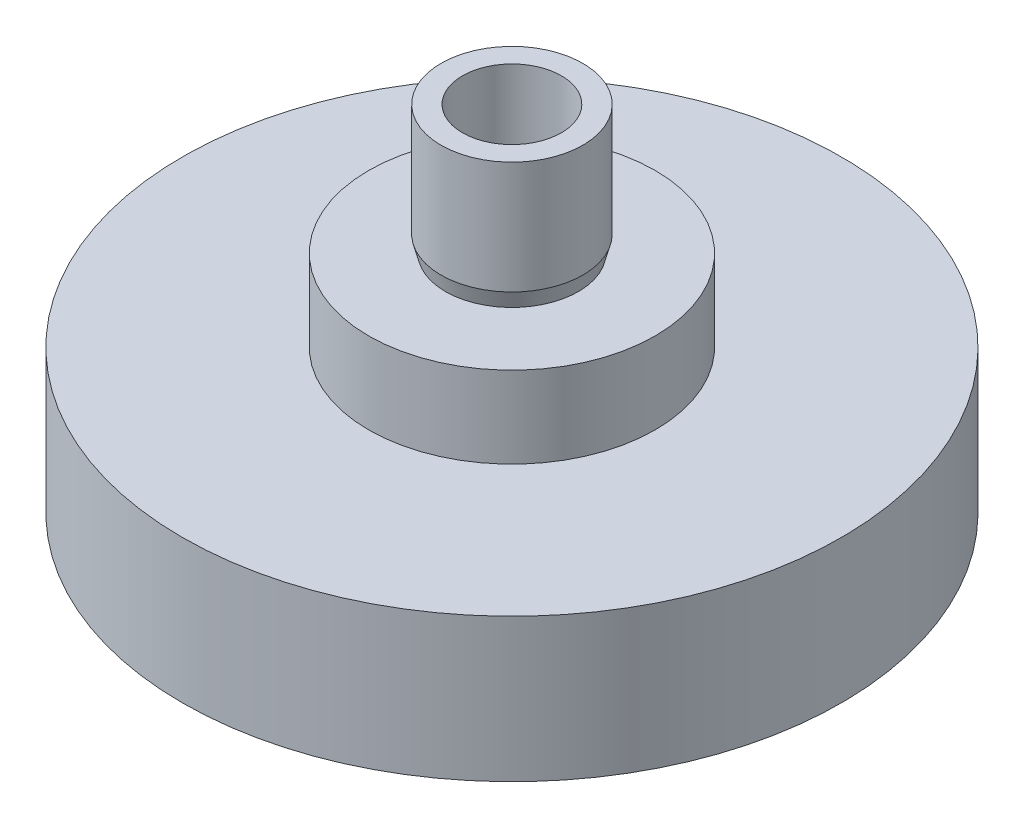
ISO-10303-21;
HEADER;
FILE_DESCRIPTION(('STEP AP214'),'2;1');
FILE_NAME('part.step','',(''),(''),'','','');
FILE_SCHEMA(('AUTOMOTIVE_DESIGN { 1 0 10303 214 1 1 1 1 }'));
ENDSEC;
DATA;
#1=APPLICATION_CONTEXT('core data for automotive mechanical design processes');
#2=APPLICATION_PROTOCOL_DEFINITION('international standard','automotive_design',2000,#1);
#3=PRODUCT_CONTEXT('',#1,'mechanical');
#4=PRODUCT('Part','Part','',(#3));
#5=PRODUCT_RELATED_PRODUCT_CATEGORY('part','',(#4));
#6=PRODUCT_DEFINITION_FORMATION('','',#4);
#7=PRODUCT_DEFINITION_CONTEXT('part definition',#1,'design');
#8=PRODUCT_DEFINITION('design','',#6,#7);
#9=PRODUCT_DEFINITION_SHAPE('','',#8);
#10=(LENGTH_UNIT() NAMED_UNIT(*) SI_UNIT(.MILLI.,.METRE.));
#11=(NAMED_UNIT(*) PLANE_ANGLE_UNIT() SI_UNIT($,.RADIAN.));
#12=(NAMED_UNIT(*) SI_UNIT($,.STERADIAN.) SOLID_ANGLE_UNIT());
#13=UNCERTAINTY_MEASURE_WITH_UNIT(LENGTH_MEASURE(1.E-05),#10,'distance_accuracy_value','');
#14=(GEOMETRIC_REPRESENTATION_CONTEXT(3) GLOBAL_UNCERTAINTY_ASSIGNED_CONTEXT((#13)) GLOBAL_UNIT_ASSIGNED_CONTEXT((#10,
#11,#12)) REPRESENTATION_CONTEXT('',''));
#15=CARTESIAN_POINT('',(0.,0.,0.));
#16=DIRECTION('',(0.,0.,1.));
#17=DIRECTION('',(1.,0.,0.));
#18=AXIS2_PLACEMENT_3D('',#15,#16,#17);
#19=CARTESIAN_POINT('',(0.,5.,0.));
#20=DIRECTION('',(0.,-1.,0.));
#21=DIRECTION('',(0.,0.,-1.));
#22=AXIS2_PLACEMENT_3D('',#19,#20,#21);
#23=CYLINDRICAL_SURFACE('',#22,11.5);
#24=CARTESIAN_POINT('',(0.,5.,0.));
#25=DIRECTION('',(0.,1.,0.));
#26=DIRECTION('',(0.,0.,1.));
#27=AXIS2_PLACEMENT_3D('',#24,#25,#26);
#28=CIRCLE('',#27,11.5);
#29=CARTESIAN_POINT('',(0.,5.,11.5));
#30=VERTEX_POINT('',#29);
#31=EDGE_CURVE('E46',#30,#30,#28,.T.);
#32=ORIENTED_EDGE('',*,*,#31,.F.);
#33=EDGE_LOOP('',(#32));
#34=FACE_BOUND('',#33,.T.);
#35=CARTESIAN_POINT('',(0.,0.,0.));
#36=DIRECTION('',(0.,1.,0.));
#37=DIRECTION('',(0.,0.,1.));
#38=AXIS2_PLACEMENT_3D('',#35,#36,#37);
#39=CIRCLE('',#38,11.5);
#40=CARTESIAN_POINT('',(0.,0.,11.5));
#41=VERTEX_POINT('',#40);
#42=EDGE_CURVE('E52',#41,#41,#39,.T.);
#43=ORIENTED_EDGE('',*,*,#42,.T.);
#44=EDGE_LOOP('',(#43));
#45=FACE_BOUND('',#44,.T.);
#46=ADVANCED_FACE('F38',(#34,#45),#23,.T.);
#47=CARTESIAN_POINT('',(0.,5.,0.));
#48=DIRECTION('',(0.,1.,0.));
#49=DIRECTION('',(0.,0.,1.));
#50=AXIS2_PLACEMENT_3D('',#47,#48,#49);
#51=PLANE('',#50);
#52=CARTESIAN_POINT('',(0.,5.,0.));
#53=DIRECTION('',(0.,1.,0.));
#54=DIRECTION('',(0.,0.,1.));
#55=AXIS2_PLACEMENT_3D('',#52,#53,#54);
#56=CIRCLE('',#55,5.);
#57=CARTESIAN_POINT('',(0.,5.,-5.));
#58=VERTEX_POINT('',#57);
#59=EDGE_CURVE('E11',#58,#58,#56,.T.);
#60=ORIENTED_EDGE('',*,*,#59,.F.);
#61=EDGE_LOOP('',(#60));
#62=FACE_BOUND('',#61,.T.);
#63=ORIENTED_EDGE('',*,*,#31,.T.);
#64=EDGE_LOOP('',(#63));
#65=FACE_BOUND('',#64,.T.);
#66=ADVANCED_FACE('F103',(#62,#65),#51,.T.);
#67=CARTESIAN_POINT('',(0.,0.,0.));
#68=DIRECTION('',(0.,1.,0.));
#69=DIRECTION('',(0.,0.,1.));
#70=AXIS2_PLACEMENT_3D('',#67,#68,#69);
#71=PLANE('',#70);
#72=CARTESIAN_POINT('',(0.,0.,0.));
#73=DIRECTION('',(0.,1.,0.));
#74=DIRECTION('',(0.,0.,1.));
#75=AXIS2_PLACEMENT_3D('',#72,#73,#74);
#76=CIRCLE('',#75,1.8);
#77=CARTESIAN_POINT('',(0.,0.,1.8));
#78=VERTEX_POINT('',#77);
#79=EDGE_CURVE('E64',#78,#78,#76,.T.);
#80=ORIENTED_EDGE('',*,*,#79,.T.);
#81=EDGE_LOOP('',(#80));
#82=FACE_BOUND('',#81,.T.);
#83=ORIENTED_EDGE('',*,*,#42,.F.);
#84=EDGE_LOOP('',(#83));
#85=FACE_BOUND('',#84,.T.);
#86=ADVANCED_FACE('F95',(#82,#85),#71,.F.);
#87=CARTESIAN_POINT('',(0.,7.84,0.));
#88=DIRECTION('',(0.,-1.,0.));
#89=DIRECTION('',(0.,0.,-1.));
#90=AXIS2_PLACEMENT_3D('',#87,#88,#89);
#91=CYLINDRICAL_SURFACE('',#90,5.);
#92=CARTESIAN_POINT('',(0.,7.84,0.));
#93=DIRECTION('',(0.,1.,0.));
#94=DIRECTION('',(0.,0.,1.));
#95=AXIS2_PLACEMENT_3D('',#92,#93,#94);
#96=CIRCLE('',#95,5.);
#97=CARTESIAN_POINT('',(0.,7.84,-5.));
#98=VERTEX_POINT('',#97);
#99=EDGE_CURVE('E55',#98,#98,#96,.T.);
#100=CARTESIAN_POINT('',(0.,7.84,-5.));
#101=CARTESIAN_POINT('',(0.,7.81041666666667,-5.));
#102=CARTESIAN_POINT('',(0.,7.78083333333333,-5.));
#103=CARTESIAN_POINT('',(0.,7.72166666666667,-5.));
#104=CARTESIAN_POINT('',(0.,7.69208333333333,-5.));
#105=CARTESIAN_POINT('',(0.,7.63291666666667,-5.));
#106=CARTESIAN_POINT('',(0.,7.60333333333333,-5.));
#107=CARTESIAN_POINT('',(0.,7.54416666666667,-5.));
#108=CARTESIAN_POINT('',(0.,7.51458333333333,-5.));
#109=CARTESIAN_POINT('',(0.,7.45541666666667,-5.));
#110=CARTESIAN_POINT('',(0.,7.42583333333333,-5.));
#111=CARTESIAN_POINT('',(0.,7.36666666666667,-5.));
#112=CARTESIAN_POINT('',(0.,7.33708333333333,-5.));
#113=CARTESIAN_POINT('',(0.,7.27791666666667,-5.));
#114=CARTESIAN_POINT('',(0.,7.24833333333333,-5.));
#115=CARTESIAN_POINT('',(0.,7.18916666666667,-5.));
#116=CARTESIAN_POINT('',(0.,7.15958333333333,-5.));
#117=CARTESIAN_POINT('',(0.,7.10041666666667,-5.));
#118=CARTESIAN_POINT('',(0.,7.07083333333333,-5.));
#119=CARTESIAN_POINT('',(0.,7.01166666666667,-5.));
#120=CARTESIAN_POINT('',(0.,6.98208333333333,-5.));
#121=CARTESIAN_POINT('',(0.,6.92291666666667,-5.));
#122=CARTESIAN_POINT('',(0.,6.89333333333333,-5.));
#123=CARTESIAN_POINT('',(0.,6.83416666666667,-5.));
#124=CARTESIAN_POINT('',(0.,6.80458333333333,-5.));
#125=CARTESIAN_POINT('',(0.,6.74541666666667,-5.));
#126=CARTESIAN_POINT('',(0.,6.71583333333333,-5.));
#127=CARTESIAN_POINT('',(0.,6.65666666666667,-5.));
#128=CARTESIAN_POINT('',(0.,6.62708333333333,-5.));
#129=CARTESIAN_POINT('',(0.,6.56791666666667,-5.));
#130=CARTESIAN_POINT('',(0.,6.53833333333333,-5.));
#131=CARTESIAN_POINT('',(0.,6.47916666666667,-5.));
#132=CARTESIAN_POINT('',(0.,6.44958333333333,-5.));
#133=CARTESIAN_POINT('',(0.,6.39041666666667,-5.));
#134=CARTESIAN_POINT('',(0.,6.36083333333333,-5.));
#135=CARTESIAN_POINT('',(0.,6.30166666666667,-5.));
#136=CARTESIAN_POINT('',(0.,6.27208333333333,-5.));
#137=CARTESIAN_POINT('',(0.,6.21291666666667,-5.));
#138=CARTESIAN_POINT('',(0.,6.18333333333333,-5.));
#139=CARTESIAN_POINT('',(0.,6.12416666666667,-5.));
#140=CARTESIAN_POINT('',(0.,6.09458333333333,-5.));
#141=CARTESIAN_POINT('',(0.,6.03541666666667,-5.));
#142=CARTESIAN_POINT('',(0.,6.00583333333333,-5.));
#143=CARTESIAN_POINT('',(0.,5.94666666666667,-5.));
#144=CARTESIAN_POINT('',(0.,5.91708333333333,-5.));
#145=CARTESIAN_POINT('',(0.,5.85791666666667,-5.));
#146=CARTESIAN_POINT('',(0.,5.82833333333333,-5.));
#147=CARTESIAN_POINT('',(0.,5.76916666666667,-5.));
#148=CARTESIAN_POINT('',(0.,5.73958333333333,-5.));
#149=CARTESIAN_POINT('',(0.,5.68041666666667,-5.));
#150=CARTESIAN_POINT('',(0.,5.65083333333333,-5.));
#151=CARTESIAN_POINT('',(0.,5.59166666666667,-5.));
#152=CARTESIAN_POINT('',(0.,5.56208333333333,-5.));
#153=CARTESIAN_POINT('',(0.,5.50291666666667,-5.));
#154=CARTESIAN_POINT('',(0.,5.47333333333333,-5.));
#155=CARTESIAN_POINT('',(0.,5.41416666666667,-5.));
#156=CARTESIAN_POINT('',(0.,5.38458333333333,-5.));
#157=CARTESIAN_POINT('',(0.,5.32541666666667,-5.));
#158=CARTESIAN_POINT('',(0.,5.29583333333333,-5.));
#159=CARTESIAN_POINT('',(0.,5.23666666666667,-5.));
#160=CARTESIAN_POINT('',(0.,5.20708333333333,-5.));
#161=CARTESIAN_POINT('',(0.,5.14791666666667,-5.));
#162=CARTESIAN_POINT('',(0.,5.11833333333333,-5.));
#163=CARTESIAN_POINT('',(0.,5.05916666666667,-5.));
#164=CARTESIAN_POINT('',(0.,5.02958333333333,-5.));
#165=CARTESIAN_POINT('',(0.,5.,-5.));
#166=B_SPLINE_CURVE_WITH_KNOTS('',3,(#100,#101,#102,#103,#104,#105,#106,#107,#108,#109,#110,
#111,#112,#113,#114,#115,#116,#117,#118,#119,#120,#121,#122,#123,#124,#125,#126,#127,#128,#129,
#130,#131,#132,#133,#134,#135,#136,#137,#138,#139,#140,#141,#142,#143,#144,#145,#146,#147,#148,
#149,#150,#151,#152,#153,#154,#155,#156,#157,#158,#159,#160,#161,#162,#163,#164,#165),
.UNSPECIFIED.,.F.,.F.,(4,2,2,2,2,2,2,2,2,2,2,2,2,2,2,2,2,2,2,2,2,2,2,2,2,2,2,2,2,2,2,2,4),(0.,
0.0887499999999994,0.177499999999999,0.266249999999999,0.354999999999999,0.443749999999999,
0.532499999999999,0.621249999999999,0.709999999999999,0.798749999999999,0.887499999999999,
0.976249999999999,1.065,1.15375,1.2425,1.33125,1.42,1.50875,1.5975,1.68625,1.775,1.86375,1.9525,
2.04125,2.13,2.21875,2.3075,2.39625,2.485,2.57375,2.6625,2.75125,2.84),.UNSPECIFIED.);
#167=EDGE_CURVE('BSEAM93',#98,#58,#166,.T.);
#168=ORIENTED_EDGE('',*,*,#99,.F.);
#169=ORIENTED_EDGE('',*,*,#59,.T.);
#170=ORIENTED_EDGE('',*,*,#167,.T.);
#171=ORIENTED_EDGE('',*,*,#167,.F.);
#172=EDGE_LOOP('',(#168,#170,#169,#171));
#173=FACE_BOUND('',#172,.T.);
#174=ADVANCED_FACE('F93',(#173),#91,.T.);
#175=CARTESIAN_POINT('',(0.,7.84,0.));
#176=DIRECTION('',(0.,1.,0.));
#177=DIRECTION('',(0.,0.,1.));
#178=AXIS2_PLACEMENT_3D('',#175,#176,#177);
#179=PLANE('',#178);
#180=ORIENTED_EDGE('',*,*,#99,.T.);
#181=EDGE_LOOP('',(#180));
#182=FACE_BOUND('',#181,.T.);
#183=CARTESIAN_POINT('',(0.,7.84,0.));
#184=DIRECTION('',(0.,1.,0.));
#185=DIRECTION('',(0.,0.,1.));
#186=AXIS2_PLACEMENT_3D('',#183,#184,#185);
#187=CIRCLE('',#186,2.32079933352687);
#188=CARTESIAN_POINT('',(0.,7.84,2.32079933352687));
#189=VERTEX_POINT('',#188);
#190=EDGE_CURVE('E81',#189,#189,#187,.T.);
#191=ORIENTED_EDGE('',*,*,#190,.F.);
#192=EDGE_LOOP('',(#191));
#193=FACE_BOUND('',#192,.T.);
#194=ADVANCED_FACE('F90',(#182,#193),#179,.T.);
#195=CARTESIAN_POINT('',(0.,12.34,0.));
#196=DIRECTION('',(0.,1.,0.));
#197=DIRECTION('',(0.,0.,1.));
#198=AXIS2_PLACEMENT_3D('',#195,#196,#197);
#199=PLANE('',#198);
#200=CARTESIAN_POINT('',(0.,12.34,0.));
#201=DIRECTION('',(0.,1.,0.));
#202=DIRECTION('',(0.,0.,1.));
#203=AXIS2_PLACEMENT_3D('',#200,#201,#202);
#204=CIRCLE('',#203,2.475);
#205=CARTESIAN_POINT('',(0.,12.34,2.475));
#206=VERTEX_POINT('',#205);
#207=EDGE_CURVE('E70',#206,#206,#204,.T.);
#208=ORIENTED_EDGE('',*,*,#207,.T.);
#209=EDGE_LOOP('',(#208));
#210=FACE_BOUND('',#209,.T.);
#211=CARTESIAN_POINT('',(0.,12.34,0.));
#212=DIRECTION('',(0.,1.,0.));
#213=DIRECTION('',(0.,0.,1.));
#214=AXIS2_PLACEMENT_3D('',#211,#212,#213);
#215=CIRCLE('',#214,1.725);
#216=CARTESIAN_POINT('',(0.,12.34,1.725));
#217=VERTEX_POINT('',#216);
#218=EDGE_CURVE('E63',#217,#217,#215,.T.);
#219=ORIENTED_EDGE('',*,*,#218,.F.);
#220=EDGE_LOOP('',(#219));
#221=FACE_BOUND('',#220,.T.);
#222=ADVANCED_FACE('F101',(#210,#221),#199,.T.);
#223=CARTESIAN_POINT('',(0.,12.34,0.));
#224=DIRECTION('',(0.,-1.,0.));
#225=DIRECTION('',(0.,0.,-1.));
#226=AXIS2_PLACEMENT_3D('',#223,#224,#225);
#227=CYLINDRICAL_SURFACE('',#226,2.475);
#228=CARTESIAN_POINT('',(0.,8.41548472183872,0.));
#229=DIRECTION('',(0.,1.,0.));
#230=DIRECTION('',(0.,0.,1.));
#231=AXIS2_PLACEMENT_3D('',#228,#229,#230);
#232=CIRCLE('',#231,2.475);
#233=CARTESIAN_POINT('',(0.,8.41548472183872,2.475));
#234=VERTEX_POINT('',#233);
#235=EDGE_CURVE('E41',#234,#234,#232,.T.);
#236=ORIENTED_EDGE('',*,*,#235,.T.);
#237=EDGE_LOOP('',(#236));
#238=FACE_BOUND('',#237,.T.);
#239=ORIENTED_EDGE('',*,*,#207,.F.);
#240=EDGE_LOOP('',(#239));
#241=FACE_BOUND('',#240,.T.);
#242=ADVANCED_FACE('F165',(#238,#241),#227,.T.);
#243=CARTESIAN_POINT('',(0.,12.34,0.));
#244=DIRECTION('',(0.,-1.,0.));
#245=DIRECTION('',(0.,0.,-1.));
#246=AXIS2_PLACEMENT_3D('',#243,#244,#245);
#247=CYLINDRICAL_SURFACE('',#246,1.725);
#248=ORIENTED_EDGE('',*,*,#218,.T.);
#249=EDGE_LOOP('',(#248));
#250=FACE_BOUND('',#249,.T.);
#251=CARTESIAN_POINT('',(0.,7.84,0.));
#252=DIRECTION('',(0.,1.,0.));
#253=DIRECTION('',(0.,0.,1.));
#254=AXIS2_PLACEMENT_3D('',#251,#252,#253);
#255=CIRCLE('',#254,1.725);
#256=CARTESIAN_POINT('',(0.,7.84,1.725));
#257=VERTEX_POINT('',#256);
#258=EDGE_CURVE('E60',#257,#257,#255,.F.);
#259=ORIENTED_EDGE('',*,*,#258,.T.);
#260=EDGE_LOOP('',(#259));
#261=FACE_BOUND('',#260,.T.);
#262=ADVANCED_FACE('F129',(#250,#261),#247,.F.);
#263=CARTESIAN_POINT('',(0.,7.84,0.));
#264=DIRECTION('',(0.,1.,0.));
#265=DIRECTION('',(0.,0.,1.));
#266=AXIS2_PLACEMENT_3D('',#263,#264,#265);
#267=PLANE('',#266);
#268=CARTESIAN_POINT('',(0.,7.84,0.));
#269=DIRECTION('',(0.,1.,0.));
#270=DIRECTION('',(0.,0.,1.));
#271=AXIS2_PLACEMENT_3D('',#268,#269,#270);
#272=CIRCLE('',#271,1.8);
#273=CARTESIAN_POINT('',(0.,7.84,1.8));
#274=VERTEX_POINT('',#273);
#275=EDGE_CURVE('E73',#274,#274,#272,.T.);
#276=ORIENTED_EDGE('',*,*,#275,.F.);
#277=EDGE_LOOP('',(#276));
#278=FACE_BOUND('',#277,.T.);
#279=ORIENTED_EDGE('',*,*,#258,.F.);
#280=EDGE_LOOP('',(#279));
#281=FACE_BOUND('',#280,.T.);
#282=ADVANCED_FACE('F134',(#278,#281),#267,.F.);
#283=CARTESIAN_POINT('',(0.,0.,0.));
#284=DIRECTION('',(0.,1.,0.));
#285=DIRECTION('',(0.,0.,1.));
#286=AXIS2_PLACEMENT_3D('',#283,#284,#285);
#287=CYLINDRICAL_SURFACE('',#286,1.8);
#288=ORIENTED_EDGE('',*,*,#79,.F.);
#289=EDGE_LOOP('',(#288));
#290=FACE_BOUND('',#289,.T.);
#291=ORIENTED_EDGE('',*,*,#275,.T.);
#292=EDGE_LOOP('',(#291));
#293=FACE_BOUND('',#292,.T.);
#294=ADVANCED_FACE('F139',(#290,#293),#287,.F.);
#295=CARTESIAN_POINT('',(0.,7.84,0.));
#296=DIRECTION('',(0.,1.,0.));
#297=DIRECTION('',(0.,0.,1.));
#298=AXIS2_PLACEMENT_3D('',#295,#296,#297);
#299=CONICAL_SURFACE('',#298,2.32079933352687,0.26179938779915);
#300=ORIENTED_EDGE('',*,*,#190,.T.);
#301=EDGE_LOOP('',(#300));
#302=FACE_BOUND('',#301,.T.);
#303=ORIENTED_EDGE('',*,*,#235,.F.);
#304=EDGE_LOOP('',(#303));
#305=FACE_BOUND('',#304,.T.);
#306=ADVANCED_FACE('F149',(#302,#305),#299,.T.);
#307=CLOSED_SHELL('',(#46,#66,#86,#174,#194,#222,#242,#262,#282,#294,#306));
#308=MANIFOLD_SOLID_BREP('B2',#307);
#309=ADVANCED_BREP_SHAPE_REPRESENTATION('',(#18,#308),#14);
#310=SHAPE_DEFINITION_REPRESENTATION(#9,#309);
ENDSEC;
END-ISO-10303-21;
